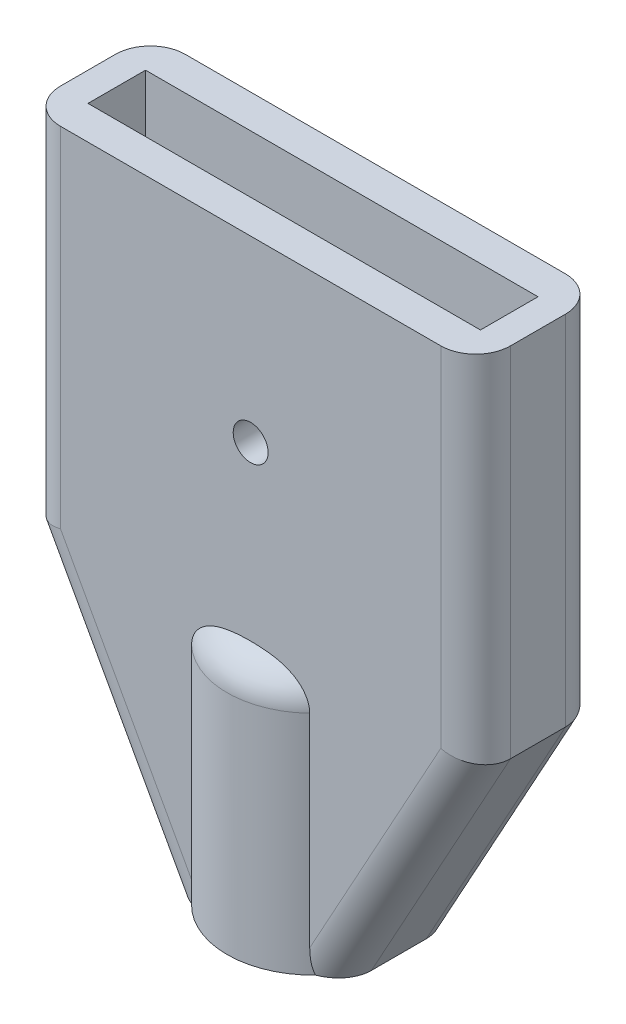
ISO-10303-21;
HEADER;
FILE_DESCRIPTION(('STEP AP214'),'2;1');
FILE_NAME('part.step','',(''),(''),'','','');
FILE_SCHEMA(('AUTOMOTIVE_DESIGN { 1 0 10303 214 1 1 1 1 }'));
ENDSEC;
DATA;
#1=APPLICATION_CONTEXT('core data for automotive mechanical design processes');
#2=APPLICATION_PROTOCOL_DEFINITION('international standard','automotive_design',2000,#1);
#3=PRODUCT_CONTEXT('',#1,'mechanical');
#4=PRODUCT('Part','Part','',(#3));
#5=PRODUCT_RELATED_PRODUCT_CATEGORY('part','',(#4));
#6=PRODUCT_DEFINITION_FORMATION('','',#4);
#7=PRODUCT_DEFINITION_CONTEXT('part definition',#1,'design');
#8=PRODUCT_DEFINITION('design','',#6,#7);
#9=PRODUCT_DEFINITION_SHAPE('','',#8);
#10=(LENGTH_UNIT() NAMED_UNIT(*) SI_UNIT(.MILLI.,.METRE.));
#11=(NAMED_UNIT(*) PLANE_ANGLE_UNIT() SI_UNIT($,.RADIAN.));
#12=(NAMED_UNIT(*) SI_UNIT($,.STERADIAN.) SOLID_ANGLE_UNIT());
#13=UNCERTAINTY_MEASURE_WITH_UNIT(LENGTH_MEASURE(1.E-05),#10,'distance_accuracy_value','');
#14=(GEOMETRIC_REPRESENTATION_CONTEXT(3) GLOBAL_UNCERTAINTY_ASSIGNED_CONTEXT((#13)) GLOBAL_UNIT_ASSIGNED_CONTEXT((#10,
#11,#12)) REPRESENTATION_CONTEXT('',''));
#15=CARTESIAN_POINT('',(0.,0.,0.));
#16=DIRECTION('',(0.,0.,1.));
#17=DIRECTION('',(1.,0.,0.));
#18=AXIS2_PLACEMENT_3D('',#15,#16,#17);
#19=CARTESIAN_POINT('',(25.8,14.5,7.15));
#20=DIRECTION('',(-1.,0.,0.));
#21=DIRECTION('',(0.,-1.,0.));
#22=AXIS2_PLACEMENT_3D('',#19,#20,#21);
#23=PLANE('',#22);
#24=DIRECTION('',(0.,0.,-1.));
#25=VECTOR('',#24,1.);
#26=CARTESIAN_POINT('',(25.8,35.,7.15));
#27=LINE('',#26,#25);
#28=CARTESIAN_POINT('',(25.8,35.,5.15));
#29=VERTEX_POINT('',#28);
#30=CARTESIAN_POINT('',(25.8,35.,2.));
#31=VERTEX_POINT('',#30);
#32=EDGE_CURVE('E194',#29,#31,#27,.T.);
#33=ORIENTED_EDGE('',*,*,#32,.F.);
#34=DIRECTION('',(0.,1.,0.));
#35=VECTOR('',#34,1.);
#36=CARTESIAN_POINT('',(25.8,14.5,5.15));
#37=LINE('',#36,#35);
#38=CARTESIAN_POINT('',(25.8,14.5,5.15));
#39=VERTEX_POINT('',#38);
#40=EDGE_CURVE('E202',#29,#39,#37,.F.);
#41=ORIENTED_EDGE('',*,*,#40,.T.);
#42=DIRECTION('',(0.,0.,-1.));
#43=VECTOR('',#42,1.);
#44=CARTESIAN_POINT('',(25.8,14.5,7.15));
#45=LINE('',#44,#43);
#46=CARTESIAN_POINT('',(25.8,14.5,2.));
#47=VERTEX_POINT('',#46);
#48=EDGE_CURVE('E382',#39,#47,#45,.T.);
#49=ORIENTED_EDGE('',*,*,#48,.T.);
#50=DIRECTION('',(0.,1.,0.));
#51=VECTOR('',#50,1.);
#52=CARTESIAN_POINT('',(25.8,35.,2.));
#53=LINE('',#52,#51);
#54=EDGE_CURVE('E68',#47,#31,#53,.T.);
#55=ORIENTED_EDGE('',*,*,#54,.T.);
#56=EDGE_LOOP('',(#33,#41,#49,#55));
#57=FACE_BOUND('',#56,.T.);
#58=ADVANCED_FACE('F49',(#57),#23,.F.);
#59=CARTESIAN_POINT('',(0.,35.,7.15));
#60=DIRECTION('',(0.,-1.,0.));
#61=DIRECTION('',(0.,0.,-1.));
#62=AXIS2_PLACEMENT_3D('',#59,#60,#61);
#63=PLANE('',#62);
#64=DIRECTION('',(-1.,0.,0.));
#65=VECTOR('',#64,1.);
#66=CARTESIAN_POINT('',(1.65,35.,1.925));
#67=LINE('',#66,#65);
#68=CARTESIAN_POINT('',(24.15,35.,1.925));
#69=VERTEX_POINT('',#68);
#70=CARTESIAN_POINT('',(1.65,35.,1.925));
#71=VERTEX_POINT('',#70);
#72=EDGE_CURVE('E345',#69,#71,#67,.T.);
#73=ORIENTED_EDGE('',*,*,#72,.F.);
#74=DIRECTION('',(0.,0.,-1.));
#75=VECTOR('',#74,1.);
#76=CARTESIAN_POINT('',(24.15,35.,5.225));
#77=LINE('',#76,#75);
#78=CARTESIAN_POINT('',(24.15,35.,5.225));
#79=VERTEX_POINT('',#78);
#80=EDGE_CURVE('E328',#79,#69,#77,.T.);
#81=ORIENTED_EDGE('',*,*,#80,.F.);
#82=DIRECTION('',(1.,0.,0.));
#83=VECTOR('',#82,1.);
#84=CARTESIAN_POINT('',(1.65,35.,5.225));
#85=LINE('',#84,#83);
#86=CARTESIAN_POINT('',(1.65,35.,5.225));
#87=VERTEX_POINT('',#86);
#88=EDGE_CURVE('E333',#87,#79,#85,.T.);
#89=ORIENTED_EDGE('',*,*,#88,.F.);
#90=DIRECTION('',(0.,0.,1.));
#91=VECTOR('',#90,1.);
#92=CARTESIAN_POINT('',(1.65,35.,5.225));
#93=LINE('',#92,#91);
#94=EDGE_CURVE('E348',#71,#87,#93,.T.);
#95=ORIENTED_EDGE('',*,*,#94,.F.);
#96=EDGE_LOOP('',(#73,#81,#89,#95));
#97=FACE_BOUND('',#96,.T.);
#98=DIRECTION('',(-1.,0.,0.));
#99=VECTOR('',#98,1.);
#100=CARTESIAN_POINT('',(0.,35.,7.15));
#101=LINE('',#100,#99);
#102=CARTESIAN_POINT('',(23.8,35.,7.15));
#103=VERTEX_POINT('',#102);
#104=CARTESIAN_POINT('',(2.,35.,7.15));
#105=VERTEX_POINT('',#104);
#106=EDGE_CURVE('E379',#103,#105,#101,.T.);
#107=ORIENTED_EDGE('',*,*,#106,.F.);
#108=CARTESIAN_POINT('',(23.8,35.,5.15));
#109=DIRECTION('',(0.,-1.,0.));
#110=DIRECTION('',(0.,0.,-1.));
#111=AXIS2_PLACEMENT_3D('',#108,#109,#110);
#112=CIRCLE('',#111,2.);
#113=EDGE_CURVE('E302',#103,#29,#112,.F.);
#114=ORIENTED_EDGE('',*,*,#113,.T.);
#115=ORIENTED_EDGE('',*,*,#32,.T.);
#116=CARTESIAN_POINT('',(23.8,35.,2.));
#117=DIRECTION('',(0.,-1.,0.));
#118=DIRECTION('',(0.,0.,-1.));
#119=AXIS2_PLACEMENT_3D('',#116,#117,#118);
#120=CIRCLE('',#119,2.);
#121=CARTESIAN_POINT('',(23.8,35.,0.));
#122=VERTEX_POINT('',#121);
#123=EDGE_CURVE('E185',#31,#122,#120,.F.);
#124=ORIENTED_EDGE('',*,*,#123,.T.);
#125=DIRECTION('',(-1.,0.,0.));
#126=VECTOR('',#125,1.);
#127=CARTESIAN_POINT('',(0.,35.,0.));
#128=LINE('',#127,#126);
#129=CARTESIAN_POINT('',(2.,35.,0.));
#130=VERTEX_POINT('',#129);
#131=EDGE_CURVE('E180',#122,#130,#128,.T.);
#132=ORIENTED_EDGE('',*,*,#131,.T.);
#133=CARTESIAN_POINT('',(2.,35.,2.));
#134=DIRECTION('',(0.,-1.,0.));
#135=DIRECTION('',(0.,0.,-1.));
#136=AXIS2_PLACEMENT_3D('',#133,#134,#135);
#137=CIRCLE('',#136,2.);
#138=CARTESIAN_POINT('',(0.,35.,2.));
#139=VERTEX_POINT('',#138);
#140=EDGE_CURVE('E173',#130,#139,#137,.F.);
#141=ORIENTED_EDGE('',*,*,#140,.T.);
#142=DIRECTION('',(0.,0.,-1.));
#143=VECTOR('',#142,1.);
#144=CARTESIAN_POINT('',(0.,35.,7.15));
#145=LINE('',#144,#143);
#146=CARTESIAN_POINT('',(0.,35.,5.15));
#147=VERTEX_POINT('',#146);
#148=EDGE_CURVE('E177',#147,#139,#145,.T.);
#149=ORIENTED_EDGE('',*,*,#148,.F.);
#150=CARTESIAN_POINT('',(2.,35.,5.15));
#151=DIRECTION('',(0.,-1.,0.));
#152=DIRECTION('',(0.,0.,-1.));
#153=AXIS2_PLACEMENT_3D('',#150,#151,#152);
#154=CIRCLE('',#153,2.);
#155=EDGE_CURVE('E184',#147,#105,#154,.F.);
#156=ORIENTED_EDGE('',*,*,#155,.T.);
#157=EDGE_LOOP('',(#107,#114,#115,#124,#132,#141,#149,#156));
#158=FACE_BOUND('',#157,.T.);
#159=ADVANCED_FACE('F176',(#97,#158),#63,.F.);
#160=CARTESIAN_POINT('',(0.,14.5,7.15));
#161=DIRECTION('',(1.,0.,0.));
#162=DIRECTION('',(0.,0.,-1.));
#163=AXIS2_PLACEMENT_3D('',#160,#161,#162);
#164=PLANE('',#163);
#165=DIRECTION('',(0.,0.,-1.));
#166=VECTOR('',#165,1.);
#167=CARTESIAN_POINT('',(0.,14.5,7.15));
#168=LINE('',#167,#166);
#169=CARTESIAN_POINT('',(0.,14.5,5.15));
#170=VERTEX_POINT('',#169);
#171=CARTESIAN_POINT('',(0.,14.5,2.));
#172=VERTEX_POINT('',#171);
#173=EDGE_CURVE('E195',#170,#172,#168,.T.);
#174=ORIENTED_EDGE('',*,*,#173,.F.);
#175=DIRECTION('',(0.,-1.,0.));
#176=VECTOR('',#175,1.);
#177=CARTESIAN_POINT('',(0.,14.5,5.15));
#178=LINE('',#177,#176);
#179=EDGE_CURVE('E193',#170,#147,#178,.F.);
#180=ORIENTED_EDGE('',*,*,#179,.T.);
#181=ORIENTED_EDGE('',*,*,#148,.T.);
#182=DIRECTION('',(0.,-1.,0.));
#183=VECTOR('',#182,1.);
#184=CARTESIAN_POINT('',(0.,14.5,2.));
#185=LINE('',#184,#183);
#186=EDGE_CURVE('E190',#139,#172,#185,.T.);
#187=ORIENTED_EDGE('',*,*,#186,.T.);
#188=EDGE_LOOP('',(#174,#180,#181,#187));
#189=FACE_BOUND('',#188,.T.);
#190=ADVANCED_FACE('F189',(#189),#164,.F.);
#191=CARTESIAN_POINT('',(0.,14.5,7.15));
#192=DIRECTION('',(0.876215908676647,0.481918749772156,0.));
#193=DIRECTION('',(-0.481918749772156,0.876215908676647,0.));
#194=AXIS2_PLACEMENT_3D('',#191,#192,#193);
#195=PLANE('',#194);
#196=DIRECTION('',(0.,0.,-1.));
#197=VECTOR('',#196,1.);
#198=CARTESIAN_POINT('',(7.975,0.,7.15));
#199=LINE('',#198,#197);
#200=CARTESIAN_POINT('',(7.975,0.,5.15));
#201=VERTEX_POINT('',#200);
#202=CARTESIAN_POINT('',(7.975,0.,2.));
#203=VERTEX_POINT('',#202);
#204=EDGE_CURVE('E388',#201,#203,#199,.T.);
#205=ORIENTED_EDGE('',*,*,#204,.F.);
#206=DIRECTION('',(0.481918749772156,-0.876215908676647,0.));
#207=VECTOR('',#206,1.);
#208=CARTESIAN_POINT('',(0.,14.5,5.15));
#209=LINE('',#208,#207);
#210=EDGE_CURVE('E422',#201,#170,#209,.F.);
#211=ORIENTED_EDGE('',*,*,#210,.T.);
#212=ORIENTED_EDGE('',*,*,#173,.T.);
#213=DIRECTION('',(0.481918749772156,-0.876215908676647,0.));
#214=VECTOR('',#213,1.);
#215=CARTESIAN_POINT('',(7.97500000000001,0.,2.));
#216=LINE('',#215,#214);
#217=EDGE_CURVE('E419',#172,#203,#216,.T.);
#218=ORIENTED_EDGE('',*,*,#217,.T.);
#219=EDGE_LOOP('',(#205,#211,#212,#218));
#220=FACE_BOUND('',#219,.T.);
#221=ADVANCED_FACE('F511',(#220),#195,.F.);
#222=CARTESIAN_POINT('',(7.975,0.,7.15));
#223=DIRECTION('',(0.,1.,0.));
#224=DIRECTION('',(-1.,0.,0.));
#225=AXIS2_PLACEMENT_3D('',#222,#223,#224);
#226=PLANE('',#225);
#227=CARTESIAN_POINT('',(12.9,0.,3.575));
#228=DIRECTION('',(0.,-1.,0.));
#229=DIRECTION('',(1.,0.,0.));
#230=AXIS2_PLACEMENT_3D('',#227,#228,#229);
#231=CIRCLE('',#230,2.925);
#232=CARTESIAN_POINT('',(15.825,0.,3.575));
#233=VERTEX_POINT('',#232);
#234=EDGE_CURVE('E356',#233,#233,#231,.T.);
#235=ORIENTED_EDGE('',*,*,#234,.F.);
#236=EDGE_LOOP('',(#235));
#237=FACE_BOUND('',#236,.T.);
#238=CARTESIAN_POINT('',(12.9,0.,3.575));
#239=DIRECTION('',(0.,-1.,0.));
#240=DIRECTION('',(1.,0.,0.));
#241=AXIS2_PLACEMENT_3D('',#238,#239,#240);
#242=CIRCLE('',#241,4.925);
#243=CARTESIAN_POINT('',(16.4553758452684,0.,6.98306801558922));
#244=VERTEX_POINT('',#243);
#245=CARTESIAN_POINT('',(9.34462415473158,0.,6.98306801558922));
#246=VERTEX_POINT('',#245);
#247=EDGE_CURVE('E372',#244,#246,#242,.T.);
#248=ORIENTED_EDGE('',*,*,#247,.T.);
#249=CARTESIAN_POINT('',(10.2575424421027,0.,5.15));
#250=DIRECTION('',(0.,1.,0.));
#251=DIRECTION('',(1.,0.,0.));
#252=AXIS2_PLACEMENT_3D('',#249,#250,#251);
#253=ELLIPSE('',#252,2.28254244210267,2.);
#254=EDGE_CURVE('E417',#246,#201,#253,.F.);
#255=ORIENTED_EDGE('',*,*,#254,.T.);
#256=ORIENTED_EDGE('',*,*,#204,.T.);
#257=CARTESIAN_POINT('',(10.2575424421027,0.,2.));
#258=DIRECTION('',(0.,1.,0.));
#259=DIRECTION('',(-1.,0.,0.));
#260=AXIS2_PLACEMENT_3D('',#257,#258,#259);
#261=ELLIPSE('',#260,2.28254244210267,2.);
#262=CARTESIAN_POINT('',(9.34462415473158,0.,0.166931984410778));
#263=VERTEX_POINT('',#262);
#264=EDGE_CURVE('E414',#203,#263,#261,.F.);
#265=ORIENTED_EDGE('',*,*,#264,.T.);
#266=CARTESIAN_POINT('',(16.4553758452684,0.,0.166931984410776));
#267=VERTEX_POINT('',#266);
#268=EDGE_CURVE('E368',#263,#267,#242,.T.);
#269=ORIENTED_EDGE('',*,*,#268,.T.);
#270=CARTESIAN_POINT('',(15.5424575578973,0.,2.));
#271=DIRECTION('',(0.,1.,0.));
#272=DIRECTION('',(-1.,0.,0.));
#273=AXIS2_PLACEMENT_3D('',#270,#271,#272);
#274=ELLIPSE('',#273,2.28254244210266,2.);
#275=CARTESIAN_POINT('',(17.825,0.,2.));
#276=VERTEX_POINT('',#275);
#277=EDGE_CURVE('E409',#267,#276,#274,.F.);
#278=ORIENTED_EDGE('',*,*,#277,.T.);
#279=DIRECTION('',(0.,0.,-1.));
#280=VECTOR('',#279,1.);
#281=CARTESIAN_POINT('',(17.825,0.,7.15));
#282=LINE('',#281,#280);
#283=CARTESIAN_POINT('',(17.825,0.,5.15));
#284=VERTEX_POINT('',#283);
#285=EDGE_CURVE('E385',#284,#276,#282,.T.);
#286=ORIENTED_EDGE('',*,*,#285,.F.);
#287=CARTESIAN_POINT('',(15.5424575578973,0.,5.15));
#288=DIRECTION('',(0.,1.,0.));
#289=DIRECTION('',(1.,0.,0.));
#290=AXIS2_PLACEMENT_3D('',#287,#288,#289);
#291=ELLIPSE('',#290,2.28254244210266,2.);
#292=EDGE_CURVE('E411',#284,#244,#291,.F.);
#293=ORIENTED_EDGE('',*,*,#292,.T.);
#294=EDGE_LOOP('',(#248,#255,#256,#265,#269,#278,#286,#293));
#295=FACE_BOUND('',#294,.T.);
#296=ADVANCED_FACE('F507',(#237,#295),#226,.F.);
#297=CARTESIAN_POINT('',(17.825,0.,7.15));
#298=DIRECTION('',(-0.876215908676647,0.481918749772156,0.));
#299=DIRECTION('',(-0.481918749772156,-0.876215908676647,0.));
#300=AXIS2_PLACEMENT_3D('',#297,#298,#299);
#301=PLANE('',#300);
#302=ORIENTED_EDGE('',*,*,#48,.F.);
#303=DIRECTION('',(0.481918749772156,0.876215908676647,0.));
#304=VECTOR('',#303,1.);
#305=CARTESIAN_POINT('',(17.825,0.,5.15));
#306=LINE('',#305,#304);
#307=EDGE_CURVE('E435',#39,#284,#306,.F.);
#308=ORIENTED_EDGE('',*,*,#307,.T.);
#309=ORIENTED_EDGE('',*,*,#285,.T.);
#310=DIRECTION('',(0.481918749772156,0.876215908676647,0.));
#311=VECTOR('',#310,1.);
#312=CARTESIAN_POINT('',(25.8,14.5,2.));
#313=LINE('',#312,#311);
#314=EDGE_CURVE('E432',#276,#47,#313,.T.);
#315=ORIENTED_EDGE('',*,*,#314,.T.);
#316=EDGE_LOOP('',(#302,#308,#309,#315));
#317=FACE_BOUND('',#316,.T.);
#318=ADVANCED_FACE('F510',(#317),#301,.F.);
#319=CARTESIAN_POINT('',(0.,0.,7.15));
#320=DIRECTION('',(0.,0.,-1.));
#321=DIRECTION('',(-1.,0.,0.));
#322=AXIS2_PLACEMENT_3D('',#319,#320,#321);
#323=PLANE('',#322);
#324=CARTESIAN_POINT('',(12.9,24.75,7.15));
#325=DIRECTION('',(0.,0.,-1.));
#326=DIRECTION('',(-1.,0.,0.));
#327=AXIS2_PLACEMENT_3D('',#324,#325,#326);
#328=CIRCLE('',#327,1.);
#329=CARTESIAN_POINT('',(11.9,24.75,7.15));
#330=VERTEX_POINT('',#329);
#331=EDGE_CURVE('E325',#330,#330,#328,.T.);
#332=ORIENTED_EDGE('',*,*,#331,.T.);
#333=EDGE_LOOP('',(#332));
#334=FACE_BOUND('',#333,.T.);
#335=DIRECTION('',(0.,-1.,0.));
#336=VECTOR('',#335,1.);
#337=CARTESIAN_POINT('',(16.2874769371909,15.,7.15));
#338=LINE('',#337,#336);
#339=CARTESIAN_POINT('',(16.2874769371909,13.,7.15));
#340=VERTEX_POINT('',#339);
#341=CARTESIAN_POINT('',(16.2874769371909,1.35458068962459,7.15));
#342=VERTEX_POINT('',#341);
#343=EDGE_CURVE('E376',#340,#342,#338,.T.);
#344=ORIENTED_EDGE('',*,*,#343,.T.);
#345=DIRECTION('',(0.481918749772156,0.876215908676647,0.));
#346=VECTOR('',#345,1.);
#347=CARTESIAN_POINT('',(11.9327889120133,-6.56303390160732,7.15));
#348=LINE('',#347,#346);
#349=CARTESIAN_POINT('',(23.8,15.0137135310958,7.15));
#350=VERTEX_POINT('',#349);
#351=EDGE_CURVE('E407',#342,#350,#348,.T.);
#352=ORIENTED_EDGE('',*,*,#351,.T.);
#353=DIRECTION('',(0.,1.,0.));
#354=VECTOR('',#353,1.);
#355=CARTESIAN_POINT('',(23.8,0.,7.15));
#356=LINE('',#355,#354);
#357=EDGE_CURVE('E304',#350,#103,#356,.T.);
#358=ORIENTED_EDGE('',*,*,#357,.T.);
#359=ORIENTED_EDGE('',*,*,#106,.T.);
#360=DIRECTION('',(0.,-1.,0.));
#361=VECTOR('',#360,1.);
#362=CARTESIAN_POINT('',(2.,0.,7.15));
#363=LINE('',#362,#361);
#364=CARTESIAN_POINT('',(2.,15.0137135310958,7.15));
#365=VERTEX_POINT('',#364);
#366=EDGE_CURVE('E402',#105,#365,#363,.T.);
#367=ORIENTED_EDGE('',*,*,#366,.T.);
#368=DIRECTION('',(0.481918749772156,-0.876215908676647,0.));
#369=VECTOR('',#368,1.);
#370=CARTESIAN_POINT('',(7.87527250833218,4.3313998795827,7.15));
#371=LINE('',#370,#369);
#372=CARTESIAN_POINT('',(9.51252306280914,1.35458068962459,7.15));
#373=VERTEX_POINT('',#372);
#374=EDGE_CURVE('E404',#365,#373,#371,.T.);
#375=ORIENTED_EDGE('',*,*,#374,.T.);
#376=DIRECTION('',(0.,-1.,0.));
#377=VECTOR('',#376,1.);
#378=CARTESIAN_POINT('',(9.51252306280914,15.,7.15));
#379=LINE('',#378,#377);
#380=CARTESIAN_POINT('',(9.51252306280914,13.,7.15));
#381=VERTEX_POINT('',#380);
#382=EDGE_CURVE('E373',#373,#381,#379,.F.);
#383=ORIENTED_EDGE('',*,*,#382,.T.);
#384=CARTESIAN_POINT('',(9.51252306280914,13.,7.15));
#385=CARTESIAN_POINT('',(9.51251864681226,13.0422950299548,7.15));
#386=CARTESIAN_POINT('',(9.51447529672763,13.0845659048171,7.15));
#387=CARTESIAN_POINT('',(9.52224788601247,13.1687310962365,7.15));
#388=CARTESIAN_POINT('',(9.52806194796538,13.2106255859332,7.15));
#389=CARTESIAN_POINT('',(9.55108683944627,13.3347101264528,7.15));
#390=CARTESIAN_POINT('',(9.57388250935939,13.4159247874481,7.15));
#391=CARTESIAN_POINT('',(9.63301002271889,13.5730255234906,7.15));
#392=CARTESIAN_POINT('',(9.66932214300312,13.6489191721235,7.15));
#393=CARTESIAN_POINT('',(9.75361392574517,13.794001781567,7.15));
#394=CARTESIAN_POINT('',(9.80161100347782,13.8631805171857,7.15));
#395=CARTESIAN_POINT('',(9.92255833120899,14.0128126302922,7.15));
#396=CARTESIAN_POINT('',(9.99870449126176,14.0906789075526,7.15));
#397=CARTESIAN_POINT('',(10.1626189568464,14.2329393188219,7.15));
#398=CARTESIAN_POINT('',(10.2504035425708,14.2973142490652,7.15));
#399=CARTESIAN_POINT('',(10.474883522119,14.43905904408,7.15));
#400=CARTESIAN_POINT('',(10.6159528326305,14.5094519116495,7.15));
#401=CARTESIAN_POINT('',(10.9070564500196,14.6277097809539,7.15));
#402=CARTESIAN_POINT('',(11.0571065476404,14.6755337058761,7.15));
#403=CARTESIAN_POINT('',(11.3464678953906,14.7498153469655,7.15));
#404=CARTESIAN_POINT('',(11.485376552367,14.7779165119018,7.15));
#405=CARTESIAN_POINT('',(11.7650055119402,14.8233293333302,7.15));
#406=CARTESIAN_POINT('',(11.9057274388033,14.8406305139466,7.15));
#407=CARTESIAN_POINT('',(12.18860795225,14.8672130082719,7.15));
#408=CARTESIAN_POINT('',(12.3307702055886,14.8764528029939,7.15));
#409=CARTESIAN_POINT('',(12.6152878766184,14.8885574987289,7.15));
#410=CARTESIAN_POINT('',(12.7576431899041,14.8914250387882,7.15));
#411=CARTESIAN_POINT('',(13.0552244785492,14.8914312956389,7.15));
#412=CARTESIAN_POINT('',(13.2104507367322,14.8880287536862,7.15));
#413=CARTESIAN_POINT('',(13.5206765773671,14.8735376295045,7.15));
#414=CARTESIAN_POINT('',(13.6756759445222,14.8624440103051,7.15));
#415=CARTESIAN_POINT('',(13.9835543149424,14.830149220518,7.15));
#416=CARTESIAN_POINT('',(14.1364405514732,14.809021228711,7.15));
#417=CARTESIAN_POINT('',(14.4395718668474,14.7529496945732,7.15));
#418=CARTESIAN_POINT('',(14.5898209604344,14.7180294814464,7.15));
#419=CARTESIAN_POINT('',(14.8465397725097,14.6412914068265,7.15));
#420=CARTESIAN_POINT('',(14.9542307261551,14.6036308678736,7.15));
#421=CARTESIAN_POINT('',(15.1648484411926,14.5162556205117,7.15));
#422=CARTESIAN_POINT('',(15.2677704495086,14.4665291815653,7.15));
#423=CARTESIAN_POINT('',(15.4667816900473,14.3528163468534,7.15));
#424=CARTESIAN_POINT('',(15.5628018626109,14.2887068289174,7.15));
#425=CARTESIAN_POINT('',(15.7428998911386,14.1453808748997,7.15));
#426=CARTESIAN_POINT('',(15.8269954245329,14.0661872171878,7.15));
#427=CARTESIAN_POINT('',(15.9604250678548,13.9134572722494,7.15));
#428=CARTESIAN_POINT('',(16.0132789775122,13.8429973317464,7.15));
#429=CARTESIAN_POINT('',(16.1066809200117,13.6943625638629,7.15));
#430=CARTESIAN_POINT('',(16.1472507397191,13.6162017250088,7.15));
#431=CARTESIAN_POINT('',(16.1978755256616,13.4929730501268,7.15));
#432=CARTESIAN_POINT('',(16.2132311692389,13.4500246798329,7.15));
#433=CARTESIAN_POINT('',(16.2397889568747,13.362850014261,7.15));
#434=CARTESIAN_POINT('',(16.2509913811338,13.3186238054106,7.15));
#435=CARTESIAN_POINT('',(16.269103261457,13.2289151879126,7.15));
#436=CARTESIAN_POINT('',(16.2759760379796,13.1834253675342,7.15));
#437=CARTESIAN_POINT('',(16.2851717728464,13.0919598071428,7.15));
#438=CARTESIAN_POINT('',(16.2874918142592,13.0459837745644,7.15));
#439=CARTESIAN_POINT('',(16.2874769371909,13.,7.15));
#440=B_SPLINE_CURVE_WITH_KNOTS('',3,(#384,#385,#386,#387,#388,#389,#390,#391,#392,#393,#394,
#395,#396,#397,#398,#399,#400,#401,#402,#403,#404,#405,#406,#407,#408,#409,#410,#411,#412,#413,
#414,#415,#416,#417,#418,#419,#420,#421,#422,#423,#424,#425,#426,#427,#428,#429,#430,#431,#432,
#433,#434,#435,#436,#437,#438,#439),.UNSPECIFIED.,.F.,.F.,(4,2,2,2,2,2,2,2,2,2,2,2,2,2,2,2,2,2,
2,2,2,2,2,2,2,2,2,4),(0.,0.126793276469681,0.253524887413198,0.505145427412984,
0.756400233732777,1.00803182800516,1.33297405516074,1.65837571430625,2.12866847220445,
2.59981392067398,3.02443795925871,3.4494732414462,3.8766848975956,4.30371959258708,
4.76935406281571,5.23529377056531,5.69788645829661,6.15970000999133,6.50138071891493,
6.84339495220265,7.18845688120352,7.5330018094485,7.79622635616847,8.05898127994947,
8.1956398452106,8.33228918900203,8.47008114683496,8.60796135900767),.UNSPECIFIED.);
#441=EDGE_CURVE('E80',#381,#340,#440,.T.);
#442=ORIENTED_EDGE('',*,*,#441,.T.);
#443=EDGE_LOOP('',(#344,#352,#358,#359,#367,#375,#383,#442));
#444=FACE_BOUND('',#443,.T.);
#445=ADVANCED_FACE('F221',(#334,#444),#323,.F.);
#446=CARTESIAN_POINT('',(0.,0.,0.));
#447=DIRECTION('',(0.,0.,-1.));
#448=DIRECTION('',(-1.,0.,0.));
#449=AXIS2_PLACEMENT_3D('',#446,#447,#448);
#450=PLANE('',#449);
#451=CARTESIAN_POINT('',(12.9,24.75,0.));
#452=DIRECTION('',(0.,0.,-1.));
#453=DIRECTION('',(-1.,0.,0.));
#454=AXIS2_PLACEMENT_3D('',#451,#452,#453);
#455=CIRCLE('',#454,1.);
#456=CARTESIAN_POINT('',(11.9,24.75,0.));
#457=VERTEX_POINT('',#456);
#458=EDGE_CURVE('E311',#457,#457,#455,.T.);
#459=ORIENTED_EDGE('',*,*,#458,.F.);
#460=EDGE_LOOP('',(#459));
#461=FACE_BOUND('',#460,.T.);
#462=DIRECTION('',(0.,-1.,0.));
#463=VECTOR('',#462,1.);
#464=CARTESIAN_POINT('',(9.51252306280914,15.,0.));
#465=LINE('',#464,#463);
#466=CARTESIAN_POINT('',(9.51252306280914,1.35458068962459,0.));
#467=VERTEX_POINT('',#466);
#468=CARTESIAN_POINT('',(9.51252306280914,13.,0.));
#469=VERTEX_POINT('',#468);
#470=EDGE_CURVE('E297',#467,#469,#465,.F.);
#471=ORIENTED_EDGE('',*,*,#470,.F.);
#472=DIRECTION('',(0.481918749772156,-0.876215908676647,0.));
#473=VECTOR('',#472,1.);
#474=CARTESIAN_POINT('',(1.75243181735329,15.4638374995443,0.));
#475=LINE('',#474,#473);
#476=CARTESIAN_POINT('',(2.,15.0137135310958,0.));
#477=VERTEX_POINT('',#476);
#478=EDGE_CURVE('E430',#467,#477,#475,.F.);
#479=ORIENTED_EDGE('',*,*,#478,.T.);
#480=DIRECTION('',(0.,-1.,0.));
#481=VECTOR('',#480,1.);
#482=CARTESIAN_POINT('',(2.,35.,0.));
#483=LINE('',#482,#481);
#484=EDGE_CURVE('E428',#477,#130,#483,.F.);
#485=ORIENTED_EDGE('',*,*,#484,.T.);
#486=ORIENTED_EDGE('',*,*,#131,.F.);
#487=DIRECTION('',(0.,1.,0.));
#488=VECTOR('',#487,1.);
#489=CARTESIAN_POINT('',(23.8,14.5,0.));
#490=LINE('',#489,#488);
#491=CARTESIAN_POINT('',(23.8,15.0137135310958,0.));
#492=VERTEX_POINT('',#491);
#493=EDGE_CURVE('E424',#122,#492,#490,.F.);
#494=ORIENTED_EDGE('',*,*,#493,.T.);
#495=DIRECTION('',(0.481918749772156,0.876215908676647,0.));
#496=VECTOR('',#495,1.);
#497=CARTESIAN_POINT('',(16.0725681826467,0.963837499544311,0.));
#498=LINE('',#497,#496);
#499=CARTESIAN_POINT('',(16.2874769371909,1.35458068962459,0.));
#500=VERTEX_POINT('',#499);
#501=EDGE_CURVE('E426',#492,#500,#498,.F.);
#502=ORIENTED_EDGE('',*,*,#501,.T.);
#503=DIRECTION('',(0.,-1.,0.));
#504=VECTOR('',#503,1.);
#505=CARTESIAN_POINT('',(16.2874769371909,15.,0.));
#506=LINE('',#505,#504);
#507=CARTESIAN_POINT('',(16.2874769371909,13.,0.));
#508=VERTEX_POINT('',#507);
#509=EDGE_CURVE('E394',#508,#500,#506,.T.);
#510=ORIENTED_EDGE('',*,*,#509,.F.);
#511=CARTESIAN_POINT('',(16.2874769371909,13.,0.));
#512=CARTESIAN_POINT('',(16.2874813531878,13.0422950299548,0.));
#513=CARTESIAN_POINT('',(16.2855247032724,13.0845659048171,0.));
#514=CARTESIAN_POINT('',(16.2777521139875,13.1687310962365,0.));
#515=CARTESIAN_POINT('',(16.2719380520346,13.2106255859332,0.));
#516=CARTESIAN_POINT('',(16.2489131605537,13.3347101264528,0.));
#517=CARTESIAN_POINT('',(16.2261174906406,13.4159247874481,0.));
#518=CARTESIAN_POINT('',(16.1669899772811,13.5730255234906,0.));
#519=CARTESIAN_POINT('',(16.1306778569969,13.6489191721235,0.));
#520=CARTESIAN_POINT('',(16.0463860742548,13.794001781567,0.));
#521=CARTESIAN_POINT('',(15.9983889965222,13.8631805171857,0.));
#522=CARTESIAN_POINT('',(15.877441668791,14.0128126302922,0.));
#523=CARTESIAN_POINT('',(15.8012955087383,14.0906789075526,0.));
#524=CARTESIAN_POINT('',(15.6373810431536,14.2329393188219,0.));
#525=CARTESIAN_POINT('',(15.5495964574292,14.2973142490652,0.));
#526=CARTESIAN_POINT('',(15.325116477881,14.43905904408,0.));
#527=CARTESIAN_POINT('',(15.1840471673695,14.5094519116495,0.));
#528=CARTESIAN_POINT('',(14.8929435499804,14.6277097809539,0.));
#529=CARTESIAN_POINT('',(14.7428934523596,14.6755337058761,0.));
#530=CARTESIAN_POINT('',(14.4535321046094,14.7498153469655,0.));
#531=CARTESIAN_POINT('',(14.314623447633,14.7779165119018,0.));
#532=CARTESIAN_POINT('',(14.0349944880598,14.8233293333302,0.));
#533=CARTESIAN_POINT('',(13.8942725611967,14.8406305139466,0.));
#534=CARTESIAN_POINT('',(13.61139204775,14.8672130082719,0.));
#535=CARTESIAN_POINT('',(13.4692297944114,14.8764528029939,0.));
#536=CARTESIAN_POINT('',(13.1847121233816,14.8885574987289,0.));
#537=CARTESIAN_POINT('',(13.0423568100959,14.8914250387882,0.));
#538=CARTESIAN_POINT('',(12.7447755214509,14.8914312956389,0.));
#539=CARTESIAN_POINT('',(12.5895492632678,14.8880287536862,0.));
#540=CARTESIAN_POINT('',(12.2793234226329,14.8735376295045,0.));
#541=CARTESIAN_POINT('',(12.1243240554778,14.8624440103051,0.));
#542=CARTESIAN_POINT('',(11.8164456850576,14.830149220518,0.));
#543=CARTESIAN_POINT('',(11.6635594485269,14.809021228711,0.));
#544=CARTESIAN_POINT('',(11.3604281331526,14.7529496945732,0.));
#545=CARTESIAN_POINT('',(11.2101790395657,14.7180294814464,0.));
#546=CARTESIAN_POINT('',(10.9534602274903,14.6412914068265,0.));
#547=CARTESIAN_POINT('',(10.8457692738449,14.6036308678736,0.));
#548=CARTESIAN_POINT('',(10.6351515588074,14.5162556205117,0.));
#549=CARTESIAN_POINT('',(10.5322295504914,14.4665291815653,0.));
#550=CARTESIAN_POINT('',(10.3332183099528,14.3528163468534,0.));
#551=CARTESIAN_POINT('',(10.2371981373892,14.2887068289174,0.));
#552=CARTESIAN_POINT('',(10.0571001088614,14.1453808748997,0.));
#553=CARTESIAN_POINT('',(9.97300457546711,14.0661872171878,0.));
#554=CARTESIAN_POINT('',(9.83957493214521,13.9134572722494,0.));
#555=CARTESIAN_POINT('',(9.78672102248778,13.8429973317464,0.));
#556=CARTESIAN_POINT('',(9.69331907998834,13.6943625638629,0.));
#557=CARTESIAN_POINT('',(9.65274926028088,13.6162017250088,0.));
#558=CARTESIAN_POINT('',(9.60212447433839,13.4929730501268,0.));
#559=CARTESIAN_POINT('',(9.58676883076108,13.4500246798329,0.));
#560=CARTESIAN_POINT('',(9.56021104312528,13.362850014261,0.));
#561=CARTESIAN_POINT('',(9.54900861886617,13.3186238054105,0.));
#562=CARTESIAN_POINT('',(9.53089673854304,13.2289151879126,0.));
#563=CARTESIAN_POINT('',(9.5240239620204,13.1834253675342,0.));
#564=CARTESIAN_POINT('',(9.51482822715357,13.0919598071428,0.));
#565=CARTESIAN_POINT('',(9.5125081857408,13.0459837745644,0.));
#566=CARTESIAN_POINT('',(9.51252306280914,13.,0.));
#567=B_SPLINE_CURVE_WITH_KNOTS('',3,(#511,#512,#513,#514,#515,#516,#517,#518,#519,#520,#521,
#522,#523,#524,#525,#526,#527,#528,#529,#530,#531,#532,#533,#534,#535,#536,#537,#538,#539,#540,
#541,#542,#543,#544,#545,#546,#547,#548,#549,#550,#551,#552,#553,#554,#555,#556,#557,#558,#559,
#560,#561,#562,#563,#564,#565,#566),.UNSPECIFIED.,.F.,.F.,(4,2,2,2,2,2,2,2,2,2,2,2,2,2,2,2,2,2,
2,2,2,2,2,2,2,2,2,4),(0.,0.126793276469683,0.2535248874132,0.505145427412984,0.756400233732775,
1.00803182800516,1.33297405516073,1.65837571430625,2.12866847220445,2.59981392067398,
3.02443795925871,3.4494732414462,3.8766848975956,4.30371959258708,4.76935406281571,
5.23529377056531,5.69788645829661,6.15970000999133,6.50138071891493,6.84339495220265,
7.18845688120351,7.5330018094485,7.79622635616847,8.05898127994947,8.1956398452106,
8.33228918900203,8.47008114683496,8.60796135900767),.UNSPECIFIED.);
#568=EDGE_CURVE('E214',#508,#469,#567,.T.);
#569=ORIENTED_EDGE('',*,*,#568,.T.);
#570=EDGE_LOOP('',(#471,#479,#485,#486,#494,#502,#510,#569));
#571=FACE_BOUND('',#570,.T.);
#572=ADVANCED_FACE('F255',(#461,#571),#450,.T.);
#573=CARTESIAN_POINT('',(12.9,15.,3.575));
#574=DIRECTION('',(0.,-1.,0.));
#575=DIRECTION('',(1.,0.,0.));
#576=AXIS2_PLACEMENT_3D('',#573,#574,#575);
#577=CYLINDRICAL_SURFACE('',#576,4.925);
#578=ORIENTED_EDGE('',*,*,#470,.T.);
#579=CARTESIAN_POINT('',(12.9,13.,3.575));
#580=DIRECTION('',(0.,-1.,0.));
#581=DIRECTION('',(1.,0.,0.));
#582=AXIS2_PLACEMENT_3D('',#579,#580,#581);
#583=CIRCLE('',#582,4.925);
#584=EDGE_CURVE('E399',#469,#508,#583,.T.);
#585=ORIENTED_EDGE('',*,*,#584,.T.);
#586=ORIENTED_EDGE('',*,*,#509,.T.);
#587=CARTESIAN_POINT('',(16.2874769371909,1.35458068962459,0.));
#588=CARTESIAN_POINT('',(16.287508143398,1.2634986602635,4.44091340686591E-05));
#589=CARTESIAN_POINT('',(16.2890054490563,1.17234789665379,0.00145029774487588));
#590=CARTESIAN_POINT('',(16.2957158048765,0.989886470734967,0.00781740095994048));
#591=CARTESIAN_POINT('',(16.300946378854,0.898577087968801,0.0127953834280956));
#592=CARTESIAN_POINT('',(16.3157555709263,0.718656337602951,0.0269954199843857));
#593=CARTESIAN_POINT('',(16.3252354666406,0.630029962495147,0.0361211747618353));
#594=CARTESIAN_POINT('',(16.3494635424297,0.454340478688105,0.0597301528271398));
#595=CARTESIAN_POINT('',(16.3642006228027,0.367274479206305,0.0742020907791762));
#596=CARTESIAN_POINT('',(16.3921611815885,0.233682421526994,0.102157622942375));
#597=CARTESIAN_POINT('',(16.4031886660831,0.186202759075833,0.113265215267406));
#598=CARTESIAN_POINT('',(16.4275204643449,0.0922048906814737,0.138066147031483));
#599=CARTESIAN_POINT('',(16.4408379196355,0.0456940754849602,0.151774461036124));
#600=CARTESIAN_POINT('',(16.4553758452684,0.,0.16693198441077));
#601=B_SPLINE_CURVE_WITH_KNOTS('',3,(#587,#588,#589,#590,#591,#592,#593,#594,#595,#596,#597,
#598,#599,#600),.UNSPECIFIED.,.F.,.F.,(4,2,2,2,2,2,4),(0.,0.273331129837848,0.547953775186401,
0.816502705885269,1.08448796217558,1.23435216838107,1.3851070042687),.UNSPECIFIED.);
#602=EDGE_CURVE('E13',#500,#267,#601,.T.);
#603=ORIENTED_EDGE('',*,*,#602,.T.);
#604=ORIENTED_EDGE('',*,*,#268,.F.);
#605=CARTESIAN_POINT('',(9.34462415473158,0.,0.166931984410778));
#606=CARTESIAN_POINT('',(9.35713477422092,0.0393183478193508,0.153885288969322));
#607=CARTESIAN_POINT('',(9.36874234943167,0.0792491771979985,0.141914662736419));
#608=CARTESIAN_POINT('',(9.39027357375747,0.160043027533156,0.119903920982557));
#609=CARTESIAN_POINT('',(9.4001988942271,0.200905076954663,0.109861888028133));
#610=CARTESIAN_POINT('',(9.42759497715685,0.324236873754205,0.0823356884068319));
#611=CARTESIAN_POINT('',(9.44278458365295,0.407773562128872,0.0673499868121913));
#612=CARTESIAN_POINT('',(9.46791741738138,0.575216565308581,0.0427584399656695));
#613=CARTESIAN_POINT('',(9.47792550724232,0.6591043600427,0.0330859845265146));
#614=CARTESIAN_POINT('',(9.49386035040729,0.827684280453998,0.0177597261537011));
#615=CARTESIAN_POINT('',(9.49978367772375,0.912377021056349,0.0121092964611941));
#616=CARTESIAN_POINT('',(9.50696215955781,1.05654710958168,0.00527531571975932));
#617=CARTESIAN_POINT('',(9.50908542967377,1.1159490879717,0.00325950222406767));
#618=CARTESIAN_POINT('',(9.51186680414081,1.23509587564818,0.000621876131930405));
#619=CARTESIAN_POINT('',(9.51251806159263,1.29484099637355,6.57777937571707E-06));
#620=CARTESIAN_POINT('',(9.51252306280914,1.35458068962459,0.));
#621=B_SPLINE_CURVE_WITH_KNOTS('',3,(#605,#606,#607,#608,#609,#610,#611,#612,#613,#614,#615,
#616,#617,#618,#619,#620),.UNSPECIFIED.,.F.,.F.,(4,2,2,2,2,2,2,4),(0.,0.129750951861454,
0.259372228081427,0.517568032999615,0.77244842500941,1.02754233211675,1.20593268527964,
1.38515110810621),.UNSPECIFIED.);
#622=EDGE_CURVE('E245',#263,#467,#621,.T.);
#623=ORIENTED_EDGE('',*,*,#622,.T.);
#624=EDGE_LOOP('',(#578,#585,#586,#603,#604,#623));
#625=FACE_BOUND('',#624,.T.);
#626=ADVANCED_FACE('F250',(#625),#577,.T.);
#627=ORIENTED_EDGE('',*,*,#343,.F.);
#628=CARTESIAN_POINT('',(12.9,13.,3.575));
#629=DIRECTION('',(0.,-1.,0.));
#630=DIRECTION('',(1.,0.,0.));
#631=AXIS2_PLACEMENT_3D('',#628,#629,#630);
#632=CIRCLE('',#631,4.925);
#633=EDGE_CURVE('E396',#340,#381,#632,.T.);
#634=ORIENTED_EDGE('',*,*,#633,.T.);
#635=ORIENTED_EDGE('',*,*,#382,.F.);
#636=CARTESIAN_POINT('',(9.51252306280914,1.35458068962459,7.15));
#637=CARTESIAN_POINT('',(9.51249185660203,1.2634986602635,7.14995559086593));
#638=CARTESIAN_POINT('',(9.51099455094372,1.17234789665379,7.14854970225513));
#639=CARTESIAN_POINT('',(9.50428419512347,0.989886470734973,7.14218259904006));
#640=CARTESIAN_POINT('',(9.49905362114599,0.898577087968807,7.13720461657191));
#641=CARTESIAN_POINT('',(9.48424442907367,0.718656337602957,7.12300458001561));
#642=CARTESIAN_POINT('',(9.47476453335938,0.630029962495152,7.11387882523817));
#643=CARTESIAN_POINT('',(9.45053645757032,0.45434047868811,7.09026984717286));
#644=CARTESIAN_POINT('',(9.43579937719733,0.367274479206311,7.07579790922082));
#645=CARTESIAN_POINT('',(9.40783881841153,0.233682421526998,7.04784237705763));
#646=CARTESIAN_POINT('',(9.39681133391686,0.186202759075836,7.0367347847326));
#647=CARTESIAN_POINT('',(9.37247953565513,0.0922048906814741,7.01193385296852));
#648=CARTESIAN_POINT('',(9.35916208036454,0.0456940754849596,6.99822553896388));
#649=CARTESIAN_POINT('',(9.34462415473165,0.,6.98306801558923));
#650=B_SPLINE_CURVE_WITH_KNOTS('',3,(#636,#637,#638,#639,#640,#641,#642,#643,#644,#645,#646,
#647,#648,#649),.UNSPECIFIED.,.F.,.F.,(4,2,2,2,2,2,4),(0.,0.273331129837848,0.5479537751864,
0.816502705885268,1.08448796217558,1.23435216838107,1.3851070042687),.UNSPECIFIED.);
#651=EDGE_CURVE('E91',#373,#246,#650,.T.);
#652=ORIENTED_EDGE('',*,*,#651,.T.);
#653=ORIENTED_EDGE('',*,*,#247,.F.);
#654=CARTESIAN_POINT('',(16.4553758452684,0.,6.98306801558922));
#655=CARTESIAN_POINT('',(16.4428652257791,0.03931834781935,6.99611471103068));
#656=CARTESIAN_POINT('',(16.4312576505683,0.0792491771979978,7.00808533726358));
#657=CARTESIAN_POINT('',(16.4097264262425,0.160043027533156,7.03009607901745));
#658=CARTESIAN_POINT('',(16.3998011057729,0.200905076954663,7.04013811197187));
#659=CARTESIAN_POINT('',(16.3724050228432,0.324236873754206,7.06766431159317));
#660=CARTESIAN_POINT('',(16.3572154163471,0.407773562128872,7.08265001318781));
#661=CARTESIAN_POINT('',(16.3320825826186,0.575216565308581,7.10724156003433));
#662=CARTESIAN_POINT('',(16.3220744927577,0.6591043600427,7.11691401547349));
#663=CARTESIAN_POINT('',(16.3061396495927,0.827684280453999,7.1322402738463));
#664=CARTESIAN_POINT('',(16.3002163222763,0.91237702105635,7.13789070353881));
#665=CARTESIAN_POINT('',(16.2930378404422,1.05654710958168,7.14472468428024));
#666=CARTESIAN_POINT('',(16.2909145703262,1.1159490879717,7.14674049777593));
#667=CARTESIAN_POINT('',(16.2881331958592,1.23509587564817,7.14937812386807));
#668=CARTESIAN_POINT('',(16.2874819384074,1.29484099637355,7.14999342222062));
#669=CARTESIAN_POINT('',(16.2874769371909,1.35458068962459,7.15));
#670=B_SPLINE_CURVE_WITH_KNOTS('',3,(#654,#655,#656,#657,#658,#659,#660,#661,#662,#663,#664,
#665,#666,#667,#668,#669),.UNSPECIFIED.,.F.,.F.,(4,2,2,2,2,2,2,4),(0.,0.129750951861454,
0.259372228081426,0.517568032999615,0.772448425009411,1.02754233211675,1.20593268527964,
1.3851511081062),.UNSPECIFIED.);
#671=EDGE_CURVE('E59',#244,#342,#670,.T.);
#672=ORIENTED_EDGE('',*,*,#671,.T.);
#673=EDGE_LOOP('',(#627,#634,#635,#652,#653,#672));
#674=FACE_BOUND('',#673,.T.);
#675=ADVANCED_FACE('F254',(#674),#577,.T.);
#676=CARTESIAN_POINT('',(12.9,13.5,3.575));
#677=DIRECTION('',(0.,-1.,0.));
#678=DIRECTION('',(1.,0.,0.));
#679=AXIS2_PLACEMENT_3D('',#676,#677,#678);
#680=CYLINDRICAL_SURFACE('',#679,2.925);
#681=CARTESIAN_POINT('',(12.9,13.5,3.575));
#682=DIRECTION('',(0.,-1.,0.));
#683=DIRECTION('',(1.,0.,0.));
#684=AXIS2_PLACEMENT_3D('',#681,#682,#683);
#685=CIRCLE('',#684,2.925);
#686=CARTESIAN_POINT('',(15.825,13.5,3.575));
#687=VERTEX_POINT('',#686);
#688=EDGE_CURVE('E365',#687,#687,#685,.T.);
#689=ORIENTED_EDGE('',*,*,#688,.F.);
#690=EDGE_LOOP('',(#689));
#691=FACE_BOUND('',#690,.T.);
#692=ORIENTED_EDGE('',*,*,#234,.T.);
#693=EDGE_LOOP('',(#692));
#694=FACE_BOUND('',#693,.T.);
#695=ADVANCED_FACE('F257',(#691,#694),#680,.F.);
#696=CARTESIAN_POINT('',(12.9,13.5,3.575));
#697=DIRECTION('',(0.,-1.,0.));
#698=DIRECTION('',(1.,0.,0.));
#699=AXIS2_PLACEMENT_3D('',#696,#697,#698);
#700=PLANE('',#699);
#701=ORIENTED_EDGE('',*,*,#688,.T.);
#702=EDGE_LOOP('',(#701));
#703=FACE_BOUND('',#702,.T.);
#704=ADVANCED_FACE('F496',(#703),#700,.T.);
#705=CARTESIAN_POINT('',(24.15,17.,5.225));
#706=DIRECTION('',(1.,0.,0.));
#707=DIRECTION('',(0.,0.,-1.));
#708=AXIS2_PLACEMENT_3D('',#705,#706,#707);
#709=PLANE('',#708);
#710=ORIENTED_EDGE('',*,*,#80,.T.);
#711=DIRECTION('',(0.,1.,0.));
#712=VECTOR('',#711,1.);
#713=CARTESIAN_POINT('',(24.15,17.,1.925));
#714=LINE('',#713,#712);
#715=CARTESIAN_POINT('',(24.15,17.,1.925));
#716=VERTEX_POINT('',#715);
#717=EDGE_CURVE('E342',#716,#69,#714,.T.);
#718=ORIENTED_EDGE('',*,*,#717,.F.);
#719=DIRECTION('',(0.,0.,-1.));
#720=VECTOR('',#719,1.);
#721=CARTESIAN_POINT('',(24.15,17.,5.225));
#722=LINE('',#721,#720);
#723=CARTESIAN_POINT('',(24.15,17.,5.225));
#724=VERTEX_POINT('',#723);
#725=EDGE_CURVE('E329',#724,#716,#722,.T.);
#726=ORIENTED_EDGE('',*,*,#725,.F.);
#727=DIRECTION('',(0.,1.,0.));
#728=VECTOR('',#727,1.);
#729=CARTESIAN_POINT('',(24.15,17.,5.225));
#730=LINE('',#729,#728);
#731=EDGE_CURVE('E353',#724,#79,#730,.T.);
#732=ORIENTED_EDGE('',*,*,#731,.T.);
#733=EDGE_LOOP('',(#710,#718,#726,#732));
#734=FACE_BOUND('',#733,.T.);
#735=ADVANCED_FACE('F468',(#734),#709,.F.);
#736=CARTESIAN_POINT('',(1.65,17.,5.225));
#737=DIRECTION('',(0.,0.,1.));
#738=DIRECTION('',(1.,0.,0.));
#739=AXIS2_PLACEMENT_3D('',#736,#737,#738);
#740=PLANE('',#739);
#741=CARTESIAN_POINT('',(12.9,24.75,5.225));
#742=DIRECTION('',(0.,0.,1.));
#743=DIRECTION('',(1.,0.,0.));
#744=AXIS2_PLACEMENT_3D('',#741,#742,#743);
#745=CIRCLE('',#744,1.);
#746=CARTESIAN_POINT('',(13.9,24.75,5.225));
#747=VERTEX_POINT('',#746);
#748=EDGE_CURVE('E320',#747,#747,#745,.T.);
#749=ORIENTED_EDGE('',*,*,#748,.T.);
#750=EDGE_LOOP('',(#749));
#751=FACE_BOUND('',#750,.T.);
#752=ORIENTED_EDGE('',*,*,#88,.T.);
#753=ORIENTED_EDGE('',*,*,#731,.F.);
#754=DIRECTION('',(1.,0.,0.));
#755=VECTOR('',#754,1.);
#756=CARTESIAN_POINT('',(1.65,17.,5.225));
#757=LINE('',#756,#755);
#758=CARTESIAN_POINT('',(1.65,17.,5.225));
#759=VERTEX_POINT('',#758);
#760=EDGE_CURVE('E339',#759,#724,#757,.T.);
#761=ORIENTED_EDGE('',*,*,#760,.F.);
#762=DIRECTION('',(0.,1.,0.));
#763=VECTOR('',#762,1.);
#764=CARTESIAN_POINT('',(1.65,17.,5.225));
#765=LINE('',#764,#763);
#766=EDGE_CURVE('E357',#759,#87,#765,.T.);
#767=ORIENTED_EDGE('',*,*,#766,.T.);
#768=EDGE_LOOP('',(#752,#753,#761,#767));
#769=FACE_BOUND('',#768,.T.);
#770=ADVANCED_FACE('F478',(#751,#769),#740,.F.);
#771=CARTESIAN_POINT('',(1.65,17.,5.225));
#772=DIRECTION('',(-1.,0.,0.));
#773=DIRECTION('',(0.,0.,1.));
#774=AXIS2_PLACEMENT_3D('',#771,#772,#773);
#775=PLANE('',#774);
#776=ORIENTED_EDGE('',*,*,#94,.T.);
#777=ORIENTED_EDGE('',*,*,#766,.F.);
#778=DIRECTION('',(0.,0.,1.));
#779=VECTOR('',#778,1.);
#780=CARTESIAN_POINT('',(1.65,17.,5.225));
#781=LINE('',#780,#779);
#782=CARTESIAN_POINT('',(1.65,17.,1.925));
#783=VERTEX_POINT('',#782);
#784=EDGE_CURVE('E336',#783,#759,#781,.T.);
#785=ORIENTED_EDGE('',*,*,#784,.F.);
#786=DIRECTION('',(0.,1.,0.));
#787=VECTOR('',#786,1.);
#788=CARTESIAN_POINT('',(1.65,17.,1.925));
#789=LINE('',#788,#787);
#790=EDGE_CURVE('E360',#783,#71,#789,.T.);
#791=ORIENTED_EDGE('',*,*,#790,.T.);
#792=EDGE_LOOP('',(#776,#777,#785,#791));
#793=FACE_BOUND('',#792,.T.);
#794=ADVANCED_FACE('F482',(#793),#775,.F.);
#795=CARTESIAN_POINT('',(1.65,17.,1.925));
#796=DIRECTION('',(0.,0.,-1.));
#797=DIRECTION('',(-1.,0.,0.));
#798=AXIS2_PLACEMENT_3D('',#795,#796,#797);
#799=PLANE('',#798);
#800=CARTESIAN_POINT('',(12.9,24.75,1.925));
#801=DIRECTION('',(0.,0.,-1.));
#802=DIRECTION('',(-1.,0.,0.));
#803=AXIS2_PLACEMENT_3D('',#800,#801,#802);
#804=CIRCLE('',#803,1.);
#805=CARTESIAN_POINT('',(11.9,24.75,1.925));
#806=VERTEX_POINT('',#805);
#807=EDGE_CURVE('E315',#806,#806,#804,.T.);
#808=ORIENTED_EDGE('',*,*,#807,.T.);
#809=EDGE_LOOP('',(#808));
#810=FACE_BOUND('',#809,.T.);
#811=ORIENTED_EDGE('',*,*,#72,.T.);
#812=ORIENTED_EDGE('',*,*,#790,.F.);
#813=DIRECTION('',(-1.,0.,0.));
#814=VECTOR('',#813,1.);
#815=CARTESIAN_POINT('',(1.65,17.,1.925));
#816=LINE('',#815,#814);
#817=EDGE_CURVE('E332',#716,#783,#816,.T.);
#818=ORIENTED_EDGE('',*,*,#817,.F.);
#819=ORIENTED_EDGE('',*,*,#717,.T.);
#820=EDGE_LOOP('',(#811,#812,#818,#819));
#821=FACE_BOUND('',#820,.T.);
#822=ADVANCED_FACE('F472',(#810,#821),#799,.F.);
#823=CARTESIAN_POINT('',(0.,17.,0.));
#824=DIRECTION('',(0.,-1.,0.));
#825=DIRECTION('',(0.,0.,-1.));
#826=AXIS2_PLACEMENT_3D('',#823,#824,#825);
#827=PLANE('',#826);
#828=ORIENTED_EDGE('',*,*,#725,.T.);
#829=ORIENTED_EDGE('',*,*,#817,.T.);
#830=ORIENTED_EDGE('',*,*,#784,.T.);
#831=ORIENTED_EDGE('',*,*,#760,.T.);
#832=EDGE_LOOP('',(#828,#829,#830,#831));
#833=FACE_BOUND('',#832,.T.);
#834=ADVANCED_FACE('F475',(#833),#827,.F.);
#835=CARTESIAN_POINT('',(12.9,24.75,8.5));
#836=DIRECTION('',(0.,0.,-1.));
#837=DIRECTION('',(-1.,0.,0.));
#838=AXIS2_PLACEMENT_3D('',#835,#836,#837);
#839=CYLINDRICAL_SURFACE('',#838,1.);
#840=ORIENTED_EDGE('',*,*,#458,.T.);
#841=EDGE_LOOP('',(#840));
#842=FACE_BOUND('',#841,.T.);
#843=ORIENTED_EDGE('',*,*,#807,.F.);
#844=EDGE_LOOP('',(#843));
#845=FACE_BOUND('',#844,.T.);
#846=ADVANCED_FACE('F551',(#842,#845),#839,.F.);
#847=ORIENTED_EDGE('',*,*,#748,.F.);
#848=EDGE_LOOP('',(#847));
#849=FACE_BOUND('',#848,.T.);
#850=ORIENTED_EDGE('',*,*,#331,.F.);
#851=EDGE_LOOP('',(#850));
#852=FACE_BOUND('',#851,.T.);
#853=ADVANCED_FACE('F229',(#849,#852),#839,.F.);
#854=CARTESIAN_POINT('',(12.9,13.,3.575));
#855=DIRECTION('',(0.,-1.,0.));
#856=DIRECTION('',(1.,0.,0.));
#857=AXIS2_PLACEMENT_3D('',#854,#855,#856);
#858=TOROIDAL_SURFACE('',#857,2.925,2.);
#859=ORIENTED_EDGE('',*,*,#633,.F.);
#860=ORIENTED_EDGE('',*,*,#441,.F.);
#861=EDGE_LOOP('',(#859,#860));
#862=FACE_BOUND('',#861,.T.);
#863=ADVANCED_FACE('F224',(#862),#858,.T.);
#864=CARTESIAN_POINT('',(12.9,13.,3.575));
#865=DIRECTION('',(0.,-1.,0.));
#866=DIRECTION('',(1.,0.,0.));
#867=AXIS2_PLACEMENT_3D('',#864,#865,#866);
#868=TOROIDAL_SURFACE('',#867,2.925,2.);
#869=ORIENTED_EDGE('',*,*,#584,.F.);
#870=ORIENTED_EDGE('',*,*,#568,.F.);
#871=EDGE_LOOP('',(#869,#870));
#872=FACE_BOUND('',#871,.T.);
#873=ADVANCED_FACE('F228',(#872),#868,.T.);
#874=CARTESIAN_POINT('',(2.,0.,5.15));
#875=DIRECTION('',(0.,-1.,0.));
#876=DIRECTION('',(0.,0.,-1.));
#877=AXIS2_PLACEMENT_3D('',#874,#875,#876);
#878=CYLINDRICAL_SURFACE('',#877,2.);
#879=ORIENTED_EDGE('',*,*,#155,.F.);
#880=ORIENTED_EDGE('',*,*,#179,.F.);
#881=CARTESIAN_POINT('',(2.,15.0137135310958,5.15));
#882=DIRECTION('',(0.248781119986378,-0.968559731941362,0.));
#883=DIRECTION('',(-0.968559731941362,-0.248781119986378,0.));
#884=AXIS2_PLACEMENT_3D('',#881,#882,#883);
#885=ELLIPSE('',#884,2.06492169150088,2.);
#886=EDGE_CURVE('E308',#365,#170,#885,.T.);
#887=ORIENTED_EDGE('',*,*,#886,.F.);
#888=ORIENTED_EDGE('',*,*,#366,.F.);
#889=EDGE_LOOP('',(#879,#880,#887,#888));
#890=FACE_BOUND('',#889,.T.);
#891=ADVANCED_FACE('F234',(#890),#878,.T.);
#892=CARTESIAN_POINT('',(7.87527250833218,4.3313998795827,5.15));
#893=DIRECTION('',(0.481918749772156,-0.876215908676647,0.));
#894=DIRECTION('',(0.876215908676647,0.481918749772156,0.));
#895=AXIS2_PLACEMENT_3D('',#892,#893,#894);
#896=CYLINDRICAL_SURFACE('',#895,2.);
#897=ORIENTED_EDGE('',*,*,#886,.T.);
#898=ORIENTED_EDGE('',*,*,#210,.F.);
#899=ORIENTED_EDGE('',*,*,#254,.F.);
#900=ORIENTED_EDGE('',*,*,#651,.F.);
#901=ORIENTED_EDGE('',*,*,#374,.F.);
#902=EDGE_LOOP('',(#897,#898,#899,#900,#901));
#903=FACE_BOUND('',#902,.T.);
#904=ADVANCED_FACE('F236',(#903),#896,.T.);
#905=CARTESIAN_POINT('',(2.,14.5,2.));
#906=DIRECTION('',(0.,1.,0.));
#907=DIRECTION('',(0.,0.,1.));
#908=AXIS2_PLACEMENT_3D('',#905,#906,#907);
#909=CYLINDRICAL_SURFACE('',#908,2.);
#910=ORIENTED_EDGE('',*,*,#140,.F.);
#911=ORIENTED_EDGE('',*,*,#484,.F.);
#912=CARTESIAN_POINT('',(2.,15.0137135310958,2.));
#913=DIRECTION('',(-0.248781119986378,0.968559731941362,0.));
#914=DIRECTION('',(0.968559731941362,0.248781119986378,0.));
#915=AXIS2_PLACEMENT_3D('',#912,#913,#914);
#916=ELLIPSE('',#915,2.06492169150088,2.);
#917=EDGE_CURVE('E200',#172,#477,#916,.F.);
#918=ORIENTED_EDGE('',*,*,#917,.F.);
#919=ORIENTED_EDGE('',*,*,#186,.F.);
#920=EDGE_LOOP('',(#910,#911,#918,#919));
#921=FACE_BOUND('',#920,.T.);
#922=ADVANCED_FACE('F198',(#921),#909,.T.);
#923=CARTESIAN_POINT('',(1.75243181735329,15.4638374995443,2.));
#924=DIRECTION('',(-0.481918749772156,0.876215908676647,0.));
#925=DIRECTION('',(-0.876215908676647,-0.481918749772156,0.));
#926=AXIS2_PLACEMENT_3D('',#923,#924,#925);
#927=CYLINDRICAL_SURFACE('',#926,2.);
#928=ORIENTED_EDGE('',*,*,#917,.T.);
#929=ORIENTED_EDGE('',*,*,#478,.F.);
#930=ORIENTED_EDGE('',*,*,#622,.F.);
#931=ORIENTED_EDGE('',*,*,#264,.F.);
#932=ORIENTED_EDGE('',*,*,#217,.F.);
#933=EDGE_LOOP('',(#928,#929,#930,#931,#932));
#934=FACE_BOUND('',#933,.T.);
#935=ADVANCED_FACE('F278',(#934),#927,.T.);
#936=CARTESIAN_POINT('',(23.8,0.,5.15));
#937=DIRECTION('',(0.,1.,0.));
#938=DIRECTION('',(-1.,0.,0.));
#939=AXIS2_PLACEMENT_3D('',#936,#937,#938);
#940=CYLINDRICAL_SURFACE('',#939,2.);
#941=ORIENTED_EDGE('',*,*,#113,.F.);
#942=ORIENTED_EDGE('',*,*,#357,.F.);
#943=CARTESIAN_POINT('',(23.8,15.0137135310958,5.15));
#944=DIRECTION('',(0.248781119986378,0.968559731941362,0.));
#945=DIRECTION('',(-0.968559731941362,0.248781119986377,0.));
#946=AXIS2_PLACEMENT_3D('',#943,#944,#945);
#947=ELLIPSE('',#946,2.06492169150088,2.);
#948=EDGE_CURVE('E303',#39,#350,#947,.F.);
#949=ORIENTED_EDGE('',*,*,#948,.F.);
#950=ORIENTED_EDGE('',*,*,#40,.F.);
#951=EDGE_LOOP('',(#941,#942,#949,#950));
#952=FACE_BOUND('',#951,.T.);
#953=ADVANCED_FACE('F275',(#952),#940,.T.);
#954=CARTESIAN_POINT('',(11.9327889120133,-6.56303390160732,5.15));
#955=DIRECTION('',(0.481918749772156,0.876215908676647,0.));
#956=DIRECTION('',(-0.876215908676647,0.481918749772156,0.));
#957=AXIS2_PLACEMENT_3D('',#954,#955,#956);
#958=CYLINDRICAL_SURFACE('',#957,2.);
#959=ORIENTED_EDGE('',*,*,#292,.F.);
#960=ORIENTED_EDGE('',*,*,#307,.F.);
#961=ORIENTED_EDGE('',*,*,#948,.T.);
#962=ORIENTED_EDGE('',*,*,#351,.F.);
#963=ORIENTED_EDGE('',*,*,#671,.F.);
#964=EDGE_LOOP('',(#959,#960,#961,#962,#963));
#965=FACE_BOUND('',#964,.T.);
#966=ADVANCED_FACE('F270',(#965),#958,.T.);
#967=CARTESIAN_POINT('',(23.8,14.5,2.));
#968=DIRECTION('',(0.,-1.,0.));
#969=DIRECTION('',(1.,0.,0.));
#970=AXIS2_PLACEMENT_3D('',#967,#968,#969);
#971=CYLINDRICAL_SURFACE('',#970,2.);
#972=ORIENTED_EDGE('',*,*,#123,.F.);
#973=ORIENTED_EDGE('',*,*,#54,.F.);
#974=CARTESIAN_POINT('',(23.8,15.0137135310958,2.));
#975=DIRECTION('',(-0.248781119986378,-0.968559731941362,0.));
#976=DIRECTION('',(0.968559731941362,-0.248781119986377,0.));
#977=AXIS2_PLACEMENT_3D('',#974,#975,#976);
#978=ELLIPSE('',#977,2.06492169150088,2.);
#979=EDGE_CURVE('E53',#492,#47,#978,.T.);
#980=ORIENTED_EDGE('',*,*,#979,.F.);
#981=ORIENTED_EDGE('',*,*,#493,.F.);
#982=EDGE_LOOP('',(#972,#973,#980,#981));
#983=FACE_BOUND('',#982,.T.);
#984=ADVANCED_FACE('F51',(#983),#971,.T.);
#985=CARTESIAN_POINT('',(16.0725681826467,0.963837499544311,2.));
#986=DIRECTION('',(-0.481918749772156,-0.876215908676647,0.));
#987=DIRECTION('',(0.876215908676647,-0.481918749772156,0.));
#988=AXIS2_PLACEMENT_3D('',#985,#986,#987);
#989=CYLINDRICAL_SURFACE('',#988,2.);
#990=ORIENTED_EDGE('',*,*,#602,.F.);
#991=ORIENTED_EDGE('',*,*,#501,.F.);
#992=ORIENTED_EDGE('',*,*,#979,.T.);
#993=ORIENTED_EDGE('',*,*,#314,.F.);
#994=ORIENTED_EDGE('',*,*,#277,.F.);
#995=EDGE_LOOP('',(#990,#991,#992,#993,#994));
#996=FACE_BOUND('',#995,.T.);
#997=ADVANCED_FACE('F280',(#996),#989,.T.);
#998=CLOSED_SHELL('',(#58,#159,#190,#221,#296,#318,#445,#572,#626,#675,#695,#704,#735,#770,#794,
#822,#834,#846,#853,#863,#873,#891,#904,#922,#935,#953,#966,#984,#997));
#999=MANIFOLD_SOLID_BREP('B2',#998);
#1000=ADVANCED_BREP_SHAPE_REPRESENTATION('',(#18,#999),#14);
#1001=SHAPE_DEFINITION_REPRESENTATION(#9,#1000);
ENDSEC;
END-ISO-10303-21;
